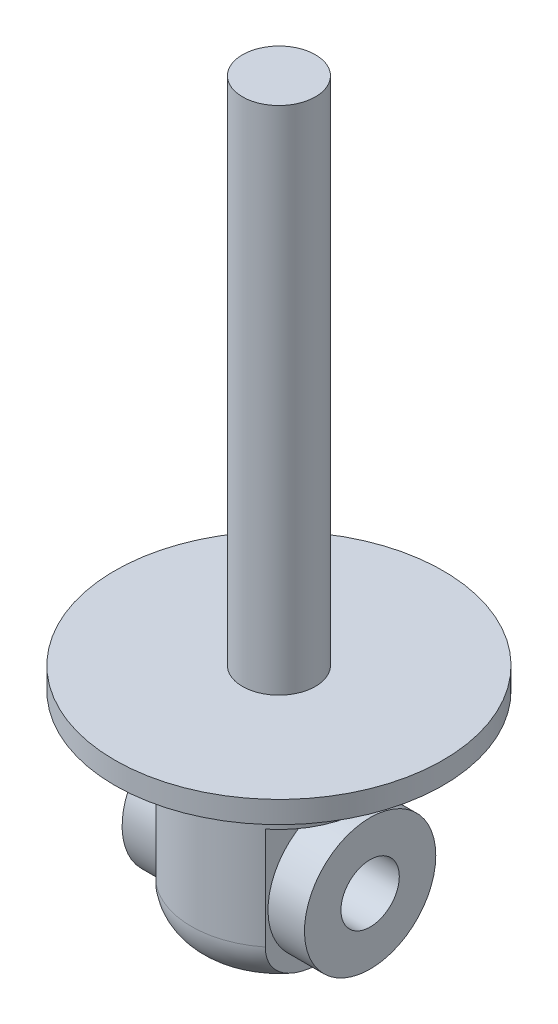
ISO-10303-21;
HEADER;
FILE_DESCRIPTION(('STEP AP214'),'2;1');
FILE_NAME('part.step','',(''),(''),'','','');
FILE_SCHEMA(('AUTOMOTIVE_DESIGN { 1 0 10303 214 1 1 1 1 }'));
ENDSEC;
DATA;
#1=APPLICATION_CONTEXT('core data for automotive mechanical design processes');
#2=APPLICATION_PROTOCOL_DEFINITION('international standard','automotive_design',2000,#1);
#3=PRODUCT_CONTEXT('',#1,'mechanical');
#4=PRODUCT('Part','Part','',(#3));
#5=PRODUCT_RELATED_PRODUCT_CATEGORY('part','',(#4));
#6=PRODUCT_DEFINITION_FORMATION('','',#4);
#7=PRODUCT_DEFINITION_CONTEXT('part definition',#1,'design');
#8=PRODUCT_DEFINITION('design','',#6,#7);
#9=PRODUCT_DEFINITION_SHAPE('','',#8);
#10=(LENGTH_UNIT() NAMED_UNIT(*) SI_UNIT(.MILLI.,.METRE.));
#11=(NAMED_UNIT(*) PLANE_ANGLE_UNIT() SI_UNIT($,.RADIAN.));
#12=(NAMED_UNIT(*) SI_UNIT($,.STERADIAN.) SOLID_ANGLE_UNIT());
#13=UNCERTAINTY_MEASURE_WITH_UNIT(LENGTH_MEASURE(1.E-05),#10,'distance_accuracy_value','');
#14=(GEOMETRIC_REPRESENTATION_CONTEXT(3) GLOBAL_UNCERTAINTY_ASSIGNED_CONTEXT((#13)) GLOBAL_UNIT_ASSIGNED_CONTEXT((#10,
#11,#12)) REPRESENTATION_CONTEXT('',''));
#15=CARTESIAN_POINT('',(0.,0.,0.));
#16=DIRECTION('',(0.,0.,1.));
#17=DIRECTION('',(1.,0.,0.));
#18=AXIS2_PLACEMENT_3D('',#15,#16,#17);
#19=CARTESIAN_POINT('',(-7.50000000000002,0.,-22.5));
#20=DIRECTION('',(1.,0.,0.));
#21=DIRECTION('',(0.,1.,0.));
#22=AXIS2_PLACEMENT_3D('',#19,#20,#21);
#23=PLANE('',#22);
#24=CARTESIAN_POINT('',(-7.50000000000001,-27.8094750193111,0.));
#25=CARTESIAN_POINT('',(-7.50000000000001,-27.8094752958151,0.18452162824242));
#26=CARTESIAN_POINT('',(-7.50000000000001,-27.8077270322999,0.369043480287192));
#27=CARTESIAN_POINT('',(-7.50000000000001,-27.8006130628877,0.737999394292286));
#28=CARTESIAN_POINT('',(-7.50000000000001,-27.7952477367066,0.922433463434386));
#29=CARTESIAN_POINT('',(-7.50000000000001,-27.780538513706,1.29122559425462));
#30=CARTESIAN_POINT('',(-7.50000000000001,-27.7711929215574,1.47558358999919));
#31=CARTESIAN_POINT('',(-7.50000000000001,-27.7479507640883,1.84401846668315));
#32=CARTESIAN_POINT('',(-7.50000000000001,-27.734054140347,2.0280953439834));
#33=CARTESIAN_POINT('',(-7.50000000000001,-27.701027325669,2.39498843631837));
#34=CARTESIAN_POINT('',(-7.50000000000001,-27.6819201299087,2.57780665418327));
#35=CARTESIAN_POINT('',(-7.50000000000001,-27.6375682217561,2.94269408038084));
#36=CARTESIAN_POINT('',(-7.50000000000001,-27.6123230495969,3.12476323156505));
#37=CARTESIAN_POINT('',(-7.50000000000001,-27.5259360262262,3.6691632505479));
#38=CARTESIAN_POINT('',(-7.50000000000001,-27.4541196223952,4.02997739530099));
#39=CARTESIAN_POINT('',(-7.50000000000001,-27.315114172541,4.57935988961709));
#40=CARTESIAN_POINT('',(-7.50000000000001,-27.2608348848703,4.7712225645297));
#41=CARTESIAN_POINT('',(-7.50000000000001,-27.1402411036094,5.15109529504943));
#42=CARTESIAN_POINT('',(-7.50000000000001,-27.0739312594077,5.3391068078654));
#43=CARTESIAN_POINT('',(-7.50000000000001,-26.9281486989919,5.70992505463464));
#44=CARTESIAN_POINT('',(-7.50000000000001,-26.8486797977089,5.8927332791208));
#45=CARTESIAN_POINT('',(-7.50000000000001,-26.6756224712841,6.25155879665883));
#46=CARTESIAN_POINT('',(-7.50000000000001,-26.5820364486501,6.42757723883459));
#47=CARTESIAN_POINT('',(-7.50000000000001,-26.3958384208508,6.74413785402998));
#48=CARTESIAN_POINT('',(-7.50000000000001,-26.3053527427416,6.8859302136676));
#49=CARTESIAN_POINT('',(-7.50000000000001,-26.1136422044668,7.16205254122039));
#50=CARTESIAN_POINT('',(-7.50000000000001,-26.0124194056704,7.29638393401336));
#51=CARTESIAN_POINT('',(-7.50000000000001,-25.7991822855038,7.55627452274061));
#52=CARTESIAN_POINT('',(-7.50000000000001,-25.6871652583255,7.6818315054992));
#53=CARTESIAN_POINT('',(-7.50000000000001,-25.4525813942248,7.92270374400352));
#54=CARTESIAN_POINT('',(-7.50000000000001,-25.3300144777409,8.03801892249803));
#55=CARTESIAN_POINT('',(-7.50000000000001,-25.0736714823962,8.25792234562975));
#56=CARTESIAN_POINT('',(-7.50000000000001,-24.9398051473305,8.36240569865935));
#57=CARTESIAN_POINT('',(-7.50000000000001,-24.662616920615,8.55796576900281));
#58=CARTESIAN_POINT('',(-7.50000000000001,-24.5192963548439,8.64904436046082));
#59=CARTESIAN_POINT('',(-7.50000000000001,-24.2243409104845,8.81636481076626));
#60=CARTESIAN_POINT('',(-7.50000000000001,-24.0727112205184,8.89261579636783));
#61=CARTESIAN_POINT('',(-7.50000000000001,-23.7624095052739,9.02909243430965));
#62=CARTESIAN_POINT('',(-7.50000000000001,-23.6037388369551,9.08932115899453));
#63=CARTESIAN_POINT('',(-7.50000000000001,-23.3052245459151,9.18495143349039));
#64=CARTESIAN_POINT('',(-7.50000000000001,-23.166136129491,9.22272405795733));
#65=CARTESIAN_POINT('',(-7.50000000000001,-22.8851087613884,9.28547940350163));
#66=CARTESIAN_POINT('',(-7.50000000000001,-22.7431701638949,9.31046370365636));
#67=CARTESIAN_POINT('',(-7.50000000000001,-22.4576599589478,9.34730641699015));
#68=CARTESIAN_POINT('',(-7.50000000000001,-22.3140890586128,9.35917031033291));
#69=CARTESIAN_POINT('',(-7.50000000000001,-22.0264648581988,9.36963164548865));
#70=CARTESIAN_POINT('',(-7.50000000000001,-21.8824115750842,9.36822954903947));
#71=CARTESIAN_POINT('',(-7.50000000000001,-21.6061914815275,9.35280339576897));
#72=CARTESIAN_POINT('',(-7.50000000000001,-21.4739684759153,9.339765699538));
#73=CARTESIAN_POINT('',(-7.50000000000001,-21.2110534946456,9.30256363878719));
#74=CARTESIAN_POINT('',(-7.50000000000001,-21.0803620180608,9.27839574533065));
#75=CARTESIAN_POINT('',(-7.50000000000001,-20.8215410609612,9.21922065645585));
#76=CARTESIAN_POINT('',(-7.50000000000001,-20.6934101253726,9.18421981495559));
#77=CARTESIAN_POINT('',(-7.50000000000001,-20.4404340442512,9.10374552536159));
#78=CARTESIAN_POINT('',(-7.50000000000001,-20.3155901493276,9.05826815366642));
#79=CARTESIAN_POINT('',(-7.50000000000001,-20.0692031015505,8.95699564520568));
#80=CARTESIAN_POINT('',(-7.50000000000001,-19.9476868658852,8.90113499399754));
#81=CARTESIAN_POINT('',(-7.50000000000001,-19.7094920695403,8.77987692751895));
#82=CARTESIAN_POINT('',(-7.50000000000001,-19.5928152563103,8.71447610526942));
#83=CARTESIAN_POINT('',(-7.50000000000001,-19.2509911073174,8.5048987585637));
#84=CARTESIAN_POINT('',(-7.50000000000001,-19.0339195251877,8.34729299116933));
#85=CARTESIAN_POINT('',(-7.50000000000001,-18.609337427954,7.98870608163152));
#86=CARTESIAN_POINT('',(-7.50000000000001,-18.4039002281567,7.785297559506));
#87=CARTESIAN_POINT('',(-7.50000000000001,-18.0246758733926,7.35109040646741));
#88=CARTESIAN_POINT('',(-7.50000000000001,-17.8508837047537,7.12029612399673));
#89=CARTESIAN_POINT('',(-7.50000000000001,-17.5744409595824,6.69864287979114));
#90=CARTESIAN_POINT('',(-7.50000000000001,-17.4648689537028,6.51223410047272));
#91=CARTESIAN_POINT('',(-7.50000000000001,-17.2626904112623,6.13034538679084));
#92=CARTESIAN_POINT('',(-7.50000000000001,-17.1700919878543,5.93486117014357));
#93=CARTESIAN_POINT('',(-7.50000000000001,-17.0006313082269,5.53658641063456));
#94=CARTESIAN_POINT('',(-7.50000000000001,-16.9238147555949,5.33377659321379));
#95=CARTESIAN_POINT('',(-7.50000000000001,-16.784875362625,4.92331428460808));
#96=CARTESIAN_POINT('',(-7.50000000000001,-16.7227484430634,4.71566315546473));
#97=CARTESIAN_POINT('',(-7.50000000000001,-16.5386673542946,4.02250667384634));
#98=CARTESIAN_POINT('',(-7.50000000000001,-16.4449803111871,3.5294265636988));
#99=CARTESIAN_POINT('',(-7.50000000000001,-16.3412352530644,2.78498720051465));
#100=CARTESIAN_POINT('',(-7.50000000000001,-16.3127705467372,2.53568557770048));
#101=CARTESIAN_POINT('',(-7.50000000000001,-16.2658269581612,2.03612434937437));
#102=CARTESIAN_POINT('',(-7.50000000000001,-16.2473468655649,1.7858648636814));
#103=CARTESIAN_POINT('',(-7.50000000000001,-16.2184283009414,1.28363112408651));
#104=CARTESIAN_POINT('',(-7.50000000000001,-16.208031590786,1.0316546617609));
#105=CARTESIAN_POINT('',(-7.50000000000001,-16.1941849220444,0.527501194688664));
#106=CARTESIAN_POINT('',(-7.50000000000001,-16.1907352988047,0.275324180848895));
#107=CARTESIAN_POINT('',(-7.50000000000001,-16.1903333462322,-0.228731345602994));
#108=CARTESIAN_POINT('',(-7.50000000000001,-16.193373232494,-0.480609853630193));
#109=CARTESIAN_POINT('',(-7.50000000000001,-16.2063332691715,-0.984173581494285));
#110=CARTESIAN_POINT('',(-7.50000000000001,-16.2162528039697,-1.23585881660876));
#111=CARTESIAN_POINT('',(-7.50000000000001,-16.2454935008677,-1.76278825668935));
#112=CARTESIAN_POINT('',(-7.50000000000001,-16.2656211327378,-2.03798990109173));
#113=CARTESIAN_POINT('',(-7.50000000000001,-16.3180418431018,-2.5873134597684));
#114=CARTESIAN_POINT('',(-7.50000000000001,-16.3503365349836,-2.86143522597445));
#115=CARTESIAN_POINT('',(-7.50000000000001,-16.4300545548583,-3.40623279358438));
#116=CARTESIAN_POINT('',(-7.50000000000001,-16.4774071358833,-3.67691867401875));
#117=CARTESIAN_POINT('',(-7.50000000000001,-16.5907053400646,-4.21439476079952));
#118=CARTESIAN_POINT('',(-7.50000000000001,-16.6566449229111,-4.48118620316471));
#119=CARTESIAN_POINT('',(-7.50000000000001,-16.7911834026755,-4.94217748017443));
#120=CARTESIAN_POINT('',(-7.50000000000001,-16.8549558474619,-5.13778160857808));
#121=CARTESIAN_POINT('',(-7.50000000000001,-16.9961265709521,-5.5239942274174));
#122=CARTESIAN_POINT('',(-7.50000000000001,-17.073520789267,-5.71460418712137));
#123=CARTESIAN_POINT('',(-7.50000000000001,-17.2430793617625,-6.08921987221889));
#124=CARTESIAN_POINT('',(-7.50000000000001,-17.3352463319138,-6.27322442084438));
#125=CARTESIAN_POINT('',(-7.50000000000001,-17.5351759469553,-6.63256976145457));
#126=CARTESIAN_POINT('',(-7.50000000000001,-17.6429345063483,-6.80791280693598));
#127=CARTESIAN_POINT('',(-7.50000000000001,-17.8487615005737,-7.10989658300674));
#128=CARTESIAN_POINT('',(-7.50000000000001,-17.9436617626469,-7.23870103997639));
#129=CARTESIAN_POINT('',(-7.50000000000001,-18.143229826346,-7.48856622066219));
#130=CARTESIAN_POINT('',(-7.50000000000001,-18.2478987883735,-7.60962602152205));
#131=CARTESIAN_POINT('',(-7.50000000000001,-18.4668045949393,-7.84271387792474));
#132=CARTESIAN_POINT('',(-7.50000000000001,-18.5810384459287,-7.95474473789612));
#133=CARTESIAN_POINT('',(-7.50000000000001,-18.8187268203134,-8.16854933672494));
#134=CARTESIAN_POINT('',(-7.50000000000001,-18.9421800591116,-8.27032449994957));
#135=CARTESIAN_POINT('',(-7.50000000000001,-19.1987356397018,-8.46313596223061));
#136=CARTESIAN_POINT('',(-7.50000000000001,-19.3319055781875,-8.55408255407202));
#137=CARTESIAN_POINT('',(-7.50000000000001,-19.6061418402457,-8.72304401015933));
#138=CARTESIAN_POINT('',(-7.50000000000001,-19.747204378254,-8.80106500403695));
#139=CARTESIAN_POINT('',(-7.50000000000001,-20.0362068877473,-8.94309470867638));
#140=CARTESIAN_POINT('',(-7.50000000000001,-20.1841460034049,-9.00710515749597));
#141=CARTESIAN_POINT('',(-7.50000000000001,-20.4856380297523,-9.12014361193692));
#142=CARTESIAN_POINT('',(-7.50000000000001,-20.6391901444676,-9.16917373274797));
#143=CARTESIAN_POINT('',(-7.50000000000001,-20.9313639562727,-9.2464339278708));
#144=CARTESIAN_POINT('',(-7.50000000000001,-21.0695088202567,-9.27647685632878));
#145=CARTESIAN_POINT('',(-7.50000000000001,-21.3479315795213,-9.3240614353689));
#146=CARTESIAN_POINT('',(-7.50000000000001,-21.4882092809527,-9.34160421520927));
#147=CARTESIAN_POINT('',(-7.50000000000001,-21.769719609589,-9.36396002322678));
#148=CARTESIAN_POINT('',(-7.50000000000001,-21.9109518422674,-9.3687780225304));
#149=CARTESIAN_POINT('',(-7.50000000000001,-22.1932734390957,-9.3656361390626));
#150=CARTESIAN_POINT('',(-7.50000000000001,-22.3343628067459,-9.35767657732181));
#151=CARTESIAN_POINT('',(-7.50000000000001,-22.6064011749062,-9.32998563551062));
#152=CARTESIAN_POINT('',(-7.50000000000001,-22.7374295539783,-9.31102660205278));
#153=CARTESIAN_POINT('',(-7.50000000000001,-22.9974780227225,-9.26218788836621));
#154=CARTESIAN_POINT('',(-7.50000000000001,-23.1264974548056,-9.23230470755186));
#155=CARTESIAN_POINT('',(-7.50000000000001,-23.3815508516768,-9.16196479385524));
#156=CARTESIAN_POINT('',(-7.50000000000001,-23.5075862018084,-9.12151307666087));
#157=CARTESIAN_POINT('',(-7.50000000000001,-23.7559772755244,-9.03044888037392));
#158=CARTESIAN_POINT('',(-7.50000000000001,-23.8783315975104,-8.97983258590812));
#159=CARTESIAN_POINT('',(-7.50000000000001,-24.1205569584555,-8.86806175742509));
#160=CARTESIAN_POINT('',(-7.50000000000001,-24.2403549182387,-8.8067487702029));
#161=CARTESIAN_POINT('',(-7.50000000000001,-24.4747211723639,-8.67480187441992));
#162=CARTESIAN_POINT('',(-7.50000000000001,-24.5892875713423,-8.60416462323316));
#163=CARTESIAN_POINT('',(-7.50000000000001,-24.9242270275788,-8.37928997825772));
#164=CARTESIAN_POINT('',(-7.50000000000001,-25.13600210755,-8.21201407264851));
#165=CARTESIAN_POINT('',(-7.50000000000001,-25.5504485361803,-7.83294273917799));
#166=CARTESIAN_POINT('',(-7.50000000000001,-25.7507010772538,-7.61853228584699));
#167=CARTESIAN_POINT('',(-7.50000000000001,-26.1185076671662,-7.16337882817297));
#168=CARTESIAN_POINT('',(-7.50000000000001,-26.2860513710234,-6.92262753032978));
#169=CARTESIAN_POINT('',(-7.50000000000001,-26.5545024709803,-6.47886643959529));
#170=CARTESIAN_POINT('',(-7.50000000000001,-26.6619013252763,-6.27970729507799));
#171=CARTESIAN_POINT('',(-7.50000000000001,-26.858559219587,-5.87254463104012));
#172=CARTESIAN_POINT('',(-7.50000000000001,-26.9478095430477,-5.664536919364));
#173=CARTESIAN_POINT('',(-7.50000000000001,-27.1096214973705,-5.24180758530232));
#174=CARTESIAN_POINT('',(-7.50000000000001,-27.1821555960046,-5.02707553901331));
#175=CARTESIAN_POINT('',(-7.50000000000001,-27.3121001369762,-4.59305326757355));
#176=CARTESIAN_POINT('',(-7.50000000000001,-27.3695048137837,-4.37376133898656));
#177=CARTESIAN_POINT('',(-7.50000000000001,-27.4981886749365,-3.81417726059936));
#178=CARTESIAN_POINT('',(-7.50000000000001,-27.5604951716191,-3.47183296905169));
#179=CARTESIAN_POINT('',(-7.50000000000001,-27.6609019684328,-2.78359200614869));
#180=CARTESIAN_POINT('',(-7.50000000000001,-27.6989863972919,-2.43769315620305));
#181=CARTESIAN_POINT('',(-7.50000000000001,-27.7425563308733,-1.91723181279187));
#182=CARTESIAN_POINT('',(-7.50000000000001,-27.7548291128016,-1.74318957751326));
#183=CARTESIAN_POINT('',(-7.50000000000001,-27.7753986995787,-1.39487161182967));
#184=CARTESIAN_POINT('',(-7.50000000000001,-27.7836956019396,-1.22059588725638));
#185=CARTESIAN_POINT('',(-7.50000000000001,-27.796777523185,-0.871965392986033));
#186=CARTESIAN_POINT('',(-7.50000000000001,-27.8015635129394,-0.697610658492164));
#187=CARTESIAN_POINT('',(-7.50000000000001,-27.8079121855994,-0.348837350643889));
#188=CARTESIAN_POINT('',(-7.50000000000001,-27.8094747579462,-0.174418775305036));
#189=CARTESIAN_POINT('',(-7.50000000000001,-27.8094750193111,0.));
#190=B_SPLINE_CURVE_WITH_KNOTS('',3,(#24,#25,#26,#27,#28,#29,#30,#31,#32,#33,#34,#35,#36,#37,
#38,#39,#40,#41,#42,#43,#44,#45,#46,#47,#48,#49,#50,#51,#52,#53,#54,#55,#56,#57,#58,#59,#60,#61,
#62,#63,#64,#65,#66,#67,#68,#69,#70,#71,#72,#73,#74,#75,#76,#77,#78,#79,#80,#81,#82,#83,#84,#85,
#86,#87,#88,#89,#90,#91,#92,#93,#94,#95,#96,#97,#98,#99,#100,#101,#102,#103,#104,#105,#106,#107,
#108,#109,#110,#111,#112,#113,#114,#115,#116,#117,#118,#119,#120,#121,#122,#123,#124,#125,#126,
#127,#128,#129,#130,#131,#132,#133,#134,#135,#136,#137,#138,#139,#140,#141,#142,#143,#144,#145,
#146,#147,#148,#149,#150,#151,#152,#153,#154,#155,#156,#157,#158,#159,#160,#161,#162,#163,#164,
#165,#166,#167,#168,#169,#170,#171,#172,#173,#174,#175,#176,#177,#178,#179,#180,#181,#182,#183,
#184,#185,#186,#187,#188,#189),.UNSPECIFIED.,.T.,.F.,(4,2,2,2,2,2,2,2,2,2,2,2,2,2,2,2,2,2,2,2,2,
2,2,2,2,2,2,2,2,2,2,2,2,2,2,2,2,2,2,2,2,2,2,2,2,2,2,2,2,2,2,2,2,2,2,2,2,2,2,2,2,2,2,2,2,2,2,2,2,
2,2,2,2,2,2,2,2,2,2,2,2,2,4),(0.,0.553556541747909,1.10705498067111,1.66078940935171,
2.21453094651203,2.7658672034967,3.31724477121586,4.41912680182767,5.01698525599298,
5.61461314908642,6.21206808675635,6.80942146164093,7.31357153503217,7.81762499361292,
8.32180513447662,8.82598907791494,9.33467160980089,9.84328295415676,10.3515802378956,
10.8597799828438,11.291588037567,11.7233427606026,12.1549170790764,12.5864763761707,
12.9845986570771,13.3828472534997,13.7808627038906,14.1790274594522,14.579795450788,
14.9807069160888,15.7821103743006,16.6461503316802,17.5100532757815,18.1578732554314,
18.8060020817716,19.4559821948789,20.1057815998326,21.6069748462106,22.3596793389022,
23.1122925673176,23.8687687149109,24.6252813779039,25.3808870860739,26.1364251884592,
26.9640249034878,27.7917343993232,28.6156111127982,29.4392203950451,30.0559954213971,
30.6725869093732,31.2892877047367,31.9058271963483,32.3853559200308,32.8649416785199,
33.3443778968313,33.823747436381,34.3068464150843,34.7897156366603,35.2725249226045,
35.7552660053908,36.1788379642465,36.6023716529343,37.0257398573389,37.4490974249689,
37.8458122806135,38.2426543730445,38.639308470493,39.0361117351622,39.4393886143668,
39.8428104576492,40.6491243408277,41.5260051520067,42.4031628508039,43.0810551134699,
43.7592721958252,44.4385984678267,45.1181832448308,46.1608437011148,47.2041866484774,
47.7275747628343,48.2509500399341,48.7741805338585,49.2974289735857),.UNSPECIFIED.);
#191=CARTESIAN_POINT('',(-7.50000000000001,-22.,-9.36749699759759));
#192=VERTEX_POINT('',#191);
#193=CARTESIAN_POINT('',(-7.50000000000001,-21.9999999999999,9.36749699759765));
#194=VERTEX_POINT('',#193);
#195=EDGE_CURVE('E144',#192,#194,#190,.T.);
#196=ORIENTED_EDGE('',*,*,#195,.T.);
#197=DIRECTION('',(0.,1.,0.));
#198=VECTOR('',#197,1.);
#199=CARTESIAN_POINT('',(-7.5,-28.,9.3674969975976));
#200=LINE('',#199,#198);
#201=CARTESIAN_POINT('',(-7.50000000000001,-8.,9.36749699759758));
#202=VERTEX_POINT('',#201);
#203=EDGE_CURVE('E98',#202,#194,#200,.F.);
#204=ORIENTED_EDGE('',*,*,#203,.F.);
#205=DIRECTION('',(0.,0.,1.));
#206=VECTOR('',#205,1.);
#207=CARTESIAN_POINT('',(-7.50000000000001,-8.,-22.5));
#208=LINE('',#207,#206);
#209=CARTESIAN_POINT('',(-7.50000000000001,-8.,-9.3674969975976));
#210=VERTEX_POINT('',#209);
#211=EDGE_CURVE('E91',#210,#202,#208,.T.);
#212=ORIENTED_EDGE('',*,*,#211,.F.);
#213=DIRECTION('',(0.,1.,0.));
#214=VECTOR('',#213,1.);
#215=CARTESIAN_POINT('',(-7.5,-28.,-9.3674969975976));
#216=LINE('',#215,#214);
#217=EDGE_CURVE('E69',#192,#210,#216,.T.);
#218=ORIENTED_EDGE('',*,*,#217,.F.);
#219=EDGE_LOOP('',(#196,#204,#212,#218));
#220=FACE_BOUND('',#219,.T.);
#221=CARTESIAN_POINT('',(-7.50000000000001,-17.809475224568,0.));
#222=DIRECTION('',(1.,0.,0.));
#223=DIRECTION('',(0.,1.,0.));
#224=AXIS2_PLACEMENT_3D('',#221,#222,#223);
#225=CIRCLE('',#224,9.);
#226=CARTESIAN_POINT('',(-7.50000000000001,-8.809475224568,0.));
#227=VERTEX_POINT('',#226);
#228=EDGE_CURVE('E12',#227,#227,#225,.F.);
#229=ORIENTED_EDGE('',*,*,#228,.F.);
#230=EDGE_LOOP('',(#229));
#231=FACE_BOUND('',#230,.T.);
#232=ADVANCED_FACE('F42',(#220,#231),#23,.F.);
#233=CARTESIAN_POINT('',(7.50000000000001,0.,-22.5));
#234=DIRECTION('',(1.,0.,0.));
#235=DIRECTION('',(0.,1.,0.));
#236=AXIS2_PLACEMENT_3D('',#233,#234,#235);
#237=PLANE('',#236);
#238=DIRECTION('',(0.,1.,0.));
#239=VECTOR('',#238,1.);
#240=CARTESIAN_POINT('',(7.50000000000001,-28.,-9.36749699759759));
#241=LINE('',#240,#239);
#242=CARTESIAN_POINT('',(7.50000000000002,-22.,-9.36749699759759));
#243=VERTEX_POINT('',#242);
#244=CARTESIAN_POINT('',(7.50000000000001,-8.,-9.36749699759759));
#245=VERTEX_POINT('',#244);
#246=EDGE_CURVE('E111',#243,#245,#241,.T.);
#247=ORIENTED_EDGE('',*,*,#246,.T.);
#248=DIRECTION('',(0.,0.,1.));
#249=VECTOR('',#248,1.);
#250=CARTESIAN_POINT('',(7.50000000000001,-8.,-22.5));
#251=LINE('',#250,#249);
#252=CARTESIAN_POINT('',(7.50000000000001,-8.,9.36749699759759));
#253=VERTEX_POINT('',#252);
#254=EDGE_CURVE('E100',#245,#253,#251,.T.);
#255=ORIENTED_EDGE('',*,*,#254,.T.);
#256=DIRECTION('',(0.,1.,0.));
#257=VECTOR('',#256,1.);
#258=CARTESIAN_POINT('',(7.50000000000001,-28.,9.36749699759759));
#259=LINE('',#258,#257);
#260=CARTESIAN_POINT('',(7.50000000000002,-22.,9.36749699759759));
#261=VERTEX_POINT('',#260);
#262=EDGE_CURVE('E61',#253,#261,#259,.F.);
#263=ORIENTED_EDGE('',*,*,#262,.T.);
#264=CARTESIAN_POINT('',(7.50000000000002,-27.8094750193111,0.));
#265=CARTESIAN_POINT('',(7.50000000000002,-27.8094752958151,0.18452162824242));
#266=CARTESIAN_POINT('',(7.50000000000002,-27.8077270322999,0.369043480287193));
#267=CARTESIAN_POINT('',(7.50000000000002,-27.8006130628877,0.737999394292287));
#268=CARTESIAN_POINT('',(7.50000000000002,-27.7952477367066,0.922433463434387));
#269=CARTESIAN_POINT('',(7.50000000000002,-27.780538513706,1.29122559425462));
#270=CARTESIAN_POINT('',(7.50000000000002,-27.7711929215574,1.47558358999919));
#271=CARTESIAN_POINT('',(7.50000000000002,-27.7479507640883,1.84401846668316));
#272=CARTESIAN_POINT('',(7.50000000000002,-27.734054140347,2.0280953439834));
#273=CARTESIAN_POINT('',(7.50000000000002,-27.701027325669,2.39498843631838));
#274=CARTESIAN_POINT('',(7.50000000000002,-27.6819201299087,2.57780665418327));
#275=CARTESIAN_POINT('',(7.50000000000002,-27.6375682217561,2.94269408038084));
#276=CARTESIAN_POINT('',(7.50000000000002,-27.6123230495969,3.12476323156506));
#277=CARTESIAN_POINT('',(7.50000000000002,-27.5259360262262,3.66916325054791));
#278=CARTESIAN_POINT('',(7.50000000000002,-27.4541196223952,4.029977395301));
#279=CARTESIAN_POINT('',(7.50000000000002,-27.315114172541,4.5793598896171));
#280=CARTESIAN_POINT('',(7.50000000000002,-27.2608348848703,4.7712225645297));
#281=CARTESIAN_POINT('',(7.50000000000002,-27.1402411036094,5.15109529504943));
#282=CARTESIAN_POINT('',(7.50000000000002,-27.0739312594077,5.3391068078654));
#283=CARTESIAN_POINT('',(7.50000000000002,-26.9281486989919,5.70992505463464));
#284=CARTESIAN_POINT('',(7.50000000000002,-26.8486797977089,5.8927332791208));
#285=CARTESIAN_POINT('',(7.50000000000002,-26.6756224712841,6.25155879665883));
#286=CARTESIAN_POINT('',(7.50000000000002,-26.5820364486501,6.42757723883459));
#287=CARTESIAN_POINT('',(7.50000000000002,-26.3958384208508,6.74413785402998));
#288=CARTESIAN_POINT('',(7.50000000000002,-26.3053527427416,6.8859302136676));
#289=CARTESIAN_POINT('',(7.50000000000002,-26.1136422044668,7.16205254122039));
#290=CARTESIAN_POINT('',(7.50000000000002,-26.0124194056704,7.29638393401336));
#291=CARTESIAN_POINT('',(7.50000000000002,-25.7991822855038,7.55627452274061));
#292=CARTESIAN_POINT('',(7.50000000000002,-25.6871652583255,7.6818315054992));
#293=CARTESIAN_POINT('',(7.50000000000002,-25.4525813942248,7.92270374400351));
#294=CARTESIAN_POINT('',(7.50000000000002,-25.3300144777409,8.03801892249802));
#295=CARTESIAN_POINT('',(7.50000000000002,-25.0736714823962,8.25792234562975));
#296=CARTESIAN_POINT('',(7.50000000000002,-24.9398051473305,8.36240569865934));
#297=CARTESIAN_POINT('',(7.50000000000002,-24.662616920615,8.55796576900281));
#298=CARTESIAN_POINT('',(7.50000000000002,-24.5192963548439,8.64904436046082));
#299=CARTESIAN_POINT('',(7.50000000000002,-24.2243409104845,8.81636481076626));
#300=CARTESIAN_POINT('',(7.50000000000002,-24.0727112205184,8.89261579636783));
#301=CARTESIAN_POINT('',(7.50000000000002,-23.7624095052739,9.02909243430964));
#302=CARTESIAN_POINT('',(7.50000000000002,-23.6037388369551,9.08932115899452));
#303=CARTESIAN_POINT('',(7.50000000000002,-23.3052245459151,9.18495143349039));
#304=CARTESIAN_POINT('',(7.50000000000002,-23.166136129491,9.22272405795732));
#305=CARTESIAN_POINT('',(7.50000000000002,-22.8851087613883,9.28547940350162));
#306=CARTESIAN_POINT('',(7.50000000000002,-22.7431701638949,9.31046370365636));
#307=CARTESIAN_POINT('',(7.50000000000002,-22.4576599589478,9.34730641699014));
#308=CARTESIAN_POINT('',(7.50000000000002,-22.3140890586128,9.35917031033291));
#309=CARTESIAN_POINT('',(7.50000000000002,-22.0264648581988,9.36963164548864));
#310=CARTESIAN_POINT('',(7.50000000000002,-21.8824115750842,9.36822954903946));
#311=CARTESIAN_POINT('',(7.50000000000002,-21.6061914815275,9.35280339576897));
#312=CARTESIAN_POINT('',(7.50000000000002,-21.4739684759153,9.339765699538));
#313=CARTESIAN_POINT('',(7.50000000000002,-21.2110534946456,9.30256363878719));
#314=CARTESIAN_POINT('',(7.50000000000002,-21.0803620180608,9.27839574533064));
#315=CARTESIAN_POINT('',(7.50000000000002,-20.8215410609612,9.21922065645584));
#316=CARTESIAN_POINT('',(7.50000000000002,-20.6934101253726,9.18421981495559));
#317=CARTESIAN_POINT('',(7.50000000000002,-20.4404340442512,9.10374552536158));
#318=CARTESIAN_POINT('',(7.50000000000002,-20.3155901493276,9.05826815366641));
#319=CARTESIAN_POINT('',(7.50000000000002,-20.0692031015505,8.95699564520567));
#320=CARTESIAN_POINT('',(7.50000000000002,-19.9476868658852,8.90113499399754));
#321=CARTESIAN_POINT('',(7.50000000000002,-19.7094920695403,8.77987692751895));
#322=CARTESIAN_POINT('',(7.50000000000002,-19.5928152563103,8.71447610526941));
#323=CARTESIAN_POINT('',(7.50000000000002,-19.2509911073174,8.5048987585637));
#324=CARTESIAN_POINT('',(7.50000000000002,-19.0339195251877,8.34729299116932));
#325=CARTESIAN_POINT('',(7.50000000000002,-18.609337427954,7.98870608163151));
#326=CARTESIAN_POINT('',(7.50000000000002,-18.4039002281567,7.78529755950599));
#327=CARTESIAN_POINT('',(7.50000000000002,-18.0246758733926,7.35109040646741));
#328=CARTESIAN_POINT('',(7.50000000000002,-17.8508837047537,7.12029612399672));
#329=CARTESIAN_POINT('',(7.50000000000002,-17.5744409595824,6.69864287979113));
#330=CARTESIAN_POINT('',(7.50000000000002,-17.4648689537028,6.51223410047271));
#331=CARTESIAN_POINT('',(7.50000000000002,-17.2626904112623,6.13034538679084));
#332=CARTESIAN_POINT('',(7.50000000000002,-17.1700919878543,5.93486117014356));
#333=CARTESIAN_POINT('',(7.50000000000002,-17.0006313082269,5.53658641063455));
#334=CARTESIAN_POINT('',(7.50000000000002,-16.9238147555949,5.33377659321378));
#335=CARTESIAN_POINT('',(7.50000000000002,-16.784875362625,4.92331428460808));
#336=CARTESIAN_POINT('',(7.50000000000002,-16.7227484430634,4.71566315546472));
#337=CARTESIAN_POINT('',(7.50000000000002,-16.5386673542946,4.02250667384633));
#338=CARTESIAN_POINT('',(7.50000000000002,-16.4449803111871,3.52942656369879));
#339=CARTESIAN_POINT('',(7.50000000000002,-16.3412352530644,2.78498720051464));
#340=CARTESIAN_POINT('',(7.50000000000002,-16.3127705467372,2.53568557770048));
#341=CARTESIAN_POINT('',(7.50000000000002,-16.2658269581612,2.03612434937436));
#342=CARTESIAN_POINT('',(7.50000000000002,-16.2473468655649,1.7858648636814));
#343=CARTESIAN_POINT('',(7.50000000000002,-16.2184283009414,1.2836311240865));
#344=CARTESIAN_POINT('',(7.50000000000002,-16.208031590786,1.03165466176089));
#345=CARTESIAN_POINT('',(7.50000000000002,-16.1941849220444,0.527501194688662));
#346=CARTESIAN_POINT('',(7.50000000000002,-16.1907352988047,0.275324180848892));
#347=CARTESIAN_POINT('',(7.50000000000002,-16.1903333462322,-0.228731345602995));
#348=CARTESIAN_POINT('',(7.50000000000002,-16.193373232494,-0.480609853630193));
#349=CARTESIAN_POINT('',(7.50000000000002,-16.2063332691715,-0.984173581494286));
#350=CARTESIAN_POINT('',(7.50000000000002,-16.2162528039697,-1.23585881660876));
#351=CARTESIAN_POINT('',(7.50000000000002,-16.2454935008677,-1.76278825668935));
#352=CARTESIAN_POINT('',(7.50000000000002,-16.2656211327378,-2.03798990109173));
#353=CARTESIAN_POINT('',(7.50000000000002,-16.3180418431018,-2.5873134597684));
#354=CARTESIAN_POINT('',(7.50000000000002,-16.3503365349836,-2.86143522597445));
#355=CARTESIAN_POINT('',(7.50000000000002,-16.4300545548583,-3.40623279358438));
#356=CARTESIAN_POINT('',(7.50000000000002,-16.4774071358833,-3.67691867401874));
#357=CARTESIAN_POINT('',(7.50000000000002,-16.5907053400646,-4.21439476079952));
#358=CARTESIAN_POINT('',(7.50000000000002,-16.6566449229111,-4.4811862031647));
#359=CARTESIAN_POINT('',(7.50000000000002,-16.7911834026755,-4.94217748017443));
#360=CARTESIAN_POINT('',(7.50000000000002,-16.8549558474619,-5.13778160857807));
#361=CARTESIAN_POINT('',(7.50000000000002,-16.9961265709521,-5.5239942274174));
#362=CARTESIAN_POINT('',(7.50000000000002,-17.073520789267,-5.71460418712137));
#363=CARTESIAN_POINT('',(7.50000000000002,-17.2430793617625,-6.08921987221889));
#364=CARTESIAN_POINT('',(7.50000000000002,-17.3352463319138,-6.27322442084439));
#365=CARTESIAN_POINT('',(7.50000000000002,-17.5351759469554,-6.63256976145457));
#366=CARTESIAN_POINT('',(7.50000000000002,-17.6429345063483,-6.80791280693598));
#367=CARTESIAN_POINT('',(7.50000000000002,-17.8487615005737,-7.10989658300674));
#368=CARTESIAN_POINT('',(7.50000000000002,-17.9436617626469,-7.23870103997639));
#369=CARTESIAN_POINT('',(7.50000000000002,-18.143229826346,-7.48856622066219));
#370=CARTESIAN_POINT('',(7.50000000000002,-18.2478987883735,-7.60962602152204));
#371=CARTESIAN_POINT('',(7.50000000000002,-18.4668045949393,-7.84271387792474));
#372=CARTESIAN_POINT('',(7.50000000000002,-18.5810384459287,-7.95474473789612));
#373=CARTESIAN_POINT('',(7.50000000000002,-18.8187268203134,-8.16854933672494));
#374=CARTESIAN_POINT('',(7.50000000000002,-18.9421800591116,-8.27032449994956));
#375=CARTESIAN_POINT('',(7.50000000000002,-19.1987356397018,-8.4631359622306));
#376=CARTESIAN_POINT('',(7.50000000000002,-19.3319055781875,-8.55408255407202));
#377=CARTESIAN_POINT('',(7.50000000000002,-19.6061418402457,-8.72304401015933));
#378=CARTESIAN_POINT('',(7.50000000000002,-19.747204378254,-8.80106500403695));
#379=CARTESIAN_POINT('',(7.50000000000002,-20.0362068877473,-8.94309470867638));
#380=CARTESIAN_POINT('',(7.50000000000002,-20.1841460034049,-9.00710515749597));
#381=CARTESIAN_POINT('',(7.50000000000002,-20.4856380297523,-9.12014361193692));
#382=CARTESIAN_POINT('',(7.50000000000002,-20.6391901444676,-9.16917373274797));
#383=CARTESIAN_POINT('',(7.50000000000002,-20.9313639562727,-9.2464339278708));
#384=CARTESIAN_POINT('',(7.50000000000002,-21.0695088202567,-9.27647685632878));
#385=CARTESIAN_POINT('',(7.50000000000002,-21.3479315795213,-9.3240614353689));
#386=CARTESIAN_POINT('',(7.50000000000002,-21.4882092809526,-9.34160421520927));
#387=CARTESIAN_POINT('',(7.50000000000002,-21.769719609589,-9.36396002322677));
#388=CARTESIAN_POINT('',(7.50000000000002,-21.9109518422674,-9.3687780225304));
#389=CARTESIAN_POINT('',(7.50000000000002,-22.1932734390957,-9.36563613906259));
#390=CARTESIAN_POINT('',(7.50000000000002,-22.3343628067459,-9.3576765773218));
#391=CARTESIAN_POINT('',(7.50000000000002,-22.6064011749062,-9.32998563551061));
#392=CARTESIAN_POINT('',(7.50000000000002,-22.7374295539783,-9.31102660205277));
#393=CARTESIAN_POINT('',(7.50000000000002,-22.9974780227225,-9.2621878883662));
#394=CARTESIAN_POINT('',(7.50000000000002,-23.1264974548056,-9.23230470755186));
#395=CARTESIAN_POINT('',(7.50000000000002,-23.3815508516768,-9.16196479385524));
#396=CARTESIAN_POINT('',(7.50000000000002,-23.5075862018083,-9.12151307666087));
#397=CARTESIAN_POINT('',(7.50000000000002,-23.7559772755244,-9.03044888037391));
#398=CARTESIAN_POINT('',(7.50000000000002,-23.8783315975104,-8.97983258590812));
#399=CARTESIAN_POINT('',(7.50000000000002,-24.1205569584555,-8.86806175742509));
#400=CARTESIAN_POINT('',(7.50000000000002,-24.2403549182387,-8.80674877020289));
#401=CARTESIAN_POINT('',(7.50000000000002,-24.4747211723639,-8.67480187441992));
#402=CARTESIAN_POINT('',(7.50000000000002,-24.5892875713423,-8.60416462323315));
#403=CARTESIAN_POINT('',(7.50000000000002,-24.9242270275788,-8.37928997825772));
#404=CARTESIAN_POINT('',(7.50000000000002,-25.13600210755,-8.21201407264851));
#405=CARTESIAN_POINT('',(7.50000000000002,-25.5504485361803,-7.83294273917799));
#406=CARTESIAN_POINT('',(7.50000000000002,-25.7507010772538,-7.61853228584698));
#407=CARTESIAN_POINT('',(7.50000000000002,-26.1185076671662,-7.16337882817297));
#408=CARTESIAN_POINT('',(7.50000000000002,-26.2860513710234,-6.92262753032978));
#409=CARTESIAN_POINT('',(7.50000000000002,-26.5545024709803,-6.47886643959529));
#410=CARTESIAN_POINT('',(7.50000000000002,-26.6619013252763,-6.27970729507798));
#411=CARTESIAN_POINT('',(7.50000000000002,-26.858559219587,-5.87254463104011));
#412=CARTESIAN_POINT('',(7.50000000000002,-26.9478095430477,-5.664536919364));
#413=CARTESIAN_POINT('',(7.50000000000002,-27.1096214973705,-5.24180758530231));
#414=CARTESIAN_POINT('',(7.50000000000002,-27.1821555960046,-5.0270755390133));
#415=CARTESIAN_POINT('',(7.50000000000002,-27.3121001369762,-4.59305326757354));
#416=CARTESIAN_POINT('',(7.50000000000002,-27.3695048137837,-4.37376133898655));
#417=CARTESIAN_POINT('',(7.50000000000002,-27.4981886749365,-3.81417726059935));
#418=CARTESIAN_POINT('',(7.50000000000002,-27.5604951716191,-3.47183296905168));
#419=CARTESIAN_POINT('',(7.50000000000002,-27.6609019684328,-2.78359200614868));
#420=CARTESIAN_POINT('',(7.50000000000002,-27.6989863972919,-2.43769315620304));
#421=CARTESIAN_POINT('',(7.50000000000002,-27.7425563308733,-1.91723181279187));
#422=CARTESIAN_POINT('',(7.50000000000002,-27.7548291128016,-1.74318957751326));
#423=CARTESIAN_POINT('',(7.50000000000002,-27.7753986995787,-1.39487161182966));
#424=CARTESIAN_POINT('',(7.50000000000002,-27.7836956019396,-1.22059588725638));
#425=CARTESIAN_POINT('',(7.50000000000002,-27.796777523185,-0.871965392986033));
#426=CARTESIAN_POINT('',(7.50000000000002,-27.8015635129393,-0.697610658492164));
#427=CARTESIAN_POINT('',(7.50000000000002,-27.8079121855994,-0.348837350643888));
#428=CARTESIAN_POINT('',(7.50000000000002,-27.8094747579462,-0.174418775305036));
#429=CARTESIAN_POINT('',(7.50000000000002,-27.8094750193111,0.));
#430=B_SPLINE_CURVE_WITH_KNOTS('',3,(#264,#265,#266,#267,#268,#269,#270,#271,#272,#273,#274,
#275,#276,#277,#278,#279,#280,#281,#282,#283,#284,#285,#286,#287,#288,#289,#290,#291,#292,#293,
#294,#295,#296,#297,#298,#299,#300,#301,#302,#303,#304,#305,#306,#307,#308,#309,#310,#311,#312,
#313,#314,#315,#316,#317,#318,#319,#320,#321,#322,#323,#324,#325,#326,#327,#328,#329,#330,#331,
#332,#333,#334,#335,#336,#337,#338,#339,#340,#341,#342,#343,#344,#345,#346,#347,#348,#349,#350,
#351,#352,#353,#354,#355,#356,#357,#358,#359,#360,#361,#362,#363,#364,#365,#366,#367,#368,#369,
#370,#371,#372,#373,#374,#375,#376,#377,#378,#379,#380,#381,#382,#383,#384,#385,#386,#387,#388,
#389,#390,#391,#392,#393,#394,#395,#396,#397,#398,#399,#400,#401,#402,#403,#404,#405,#406,#407,
#408,#409,#410,#411,#412,#413,#414,#415,#416,#417,#418,#419,#420,#421,#422,#423,#424,#425,#426,
#427,#428,#429),.UNSPECIFIED.,.T.,.F.,(4,2,2,2,2,2,2,2,2,2,2,2,2,2,2,2,2,2,2,2,2,2,2,2,2,2,2,2,
2,2,2,2,2,2,2,2,2,2,2,2,2,2,2,2,2,2,2,2,2,2,2,2,2,2,2,2,2,2,2,2,2,2,2,2,2,2,2,2,2,2,2,2,2,2,2,2,
2,2,2,2,2,2,4),(0.,0.55355654174791,1.10705498067111,1.66078940935171,2.21453094651204,
2.7658672034967,3.31724477121586,4.41912680182768,5.01698525599298,5.61461314908643,
6.21206808675634,6.80942146164093,7.31357153503217,7.81762499361292,8.32180513447662,
8.82598907791493,9.33467160980088,9.84328295415676,10.3515802378956,10.8597799828438,
11.291588037567,11.7233427606026,12.1549170790764,12.5864763761706,12.9845986570771,
13.3828472534997,13.7808627038906,14.1790274594521,14.579795450788,14.9807069160888,
15.7821103743006,16.6461503316802,17.5100532757814,18.1578732554314,18.8060020817716,
19.4559821948788,20.1057815998326,21.6069748462105,22.3596793389022,23.1122925673176,
23.8687687149109,24.6252813779039,25.3808870860739,26.1364251884592,26.9640249034878,
27.7917343993232,28.6156111127982,29.4392203950451,30.0559954213971,30.6725869093732,
31.2892877047367,31.9058271963482,32.3853559200307,32.8649416785199,33.3443778968313,
33.823747436381,34.3068464150843,34.7897156366603,35.2725249226045,35.7552660053907,
36.1788379642464,36.6023716529342,37.0257398573389,37.4490974249688,37.8458122806135,
38.2426543730444,38.6393084704929,39.0361117351622,39.4393886143667,39.8428104576491,
40.6491243408276,41.5260051520067,42.4031628508039,43.0810551134699,43.7592721958252,
44.4385984678267,45.1181832448308,46.1608437011148,47.2041866484774,47.7275747628343,
48.250950039934,48.7741805338585,49.2974289735856),.UNSPECIFIED.);
#431=EDGE_CURVE('E95',#243,#261,#430,.T.);
#432=ORIENTED_EDGE('',*,*,#431,.F.);
#433=EDGE_LOOP('',(#247,#255,#263,#432));
#434=FACE_BOUND('',#433,.T.);
#435=CARTESIAN_POINT('',(7.50000000000002,-17.809475224568,0.));
#436=DIRECTION('',(1.,0.,0.));
#437=DIRECTION('',(0.,1.,0.));
#438=AXIS2_PLACEMENT_3D('',#435,#436,#437);
#439=CIRCLE('',#438,9.);
#440=CARTESIAN_POINT('',(7.50000000000002,-8.809475224568,0.));
#441=VERTEX_POINT('',#440);
#442=EDGE_CURVE('E47',#441,#441,#439,.F.);
#443=ORIENTED_EDGE('',*,*,#442,.T.);
#444=EDGE_LOOP('',(#443));
#445=FACE_BOUND('',#444,.T.);
#446=ADVANCED_FACE('F159',(#434,#445),#237,.T.);
#447=CARTESIAN_POINT('',(0.,-28.,0.));
#448=DIRECTION('',(0.,1.,0.));
#449=DIRECTION('',(0.,0.,1.));
#450=AXIS2_PLACEMENT_3D('',#447,#448,#449);
#451=CYLINDRICAL_SURFACE('',#450,12.);
#452=CARTESIAN_POINT('',(0.,0.,0.));
#453=DIRECTION('',(0.,-1.,0.));
#454=DIRECTION('',(0.,0.,-1.));
#455=AXIS2_PLACEMENT_3D('',#452,#453,#454);
#456=CIRCLE('',#455,12.);
#457=CARTESIAN_POINT('',(0.,0.,-12.));
#458=VERTEX_POINT('',#457);
#459=EDGE_CURVE('E118',#458,#458,#456,.T.);
#460=ORIENTED_EDGE('',*,*,#459,.T.);
#461=EDGE_LOOP('',(#460));
#462=FACE_BOUND('',#461,.T.);
#463=ORIENTED_EDGE('',*,*,#246,.F.);
#464=CARTESIAN_POINT('',(0.,-22.,0.));
#465=DIRECTION('',(0.,-1.,0.));
#466=DIRECTION('',(0.,0.,-1.));
#467=AXIS2_PLACEMENT_3D('',#464,#465,#466);
#468=CIRCLE('',#467,12.);
#469=EDGE_CURVE('E106',#243,#192,#468,.F.);
#470=ORIENTED_EDGE('',*,*,#469,.T.);
#471=ORIENTED_EDGE('',*,*,#217,.T.);
#472=CARTESIAN_POINT('',(0.,-8.,0.));
#473=DIRECTION('',(0.,1.,0.));
#474=DIRECTION('',(-1.,0.,0.));
#475=AXIS2_PLACEMENT_3D('',#472,#473,#474);
#476=CIRCLE('',#475,12.);
#477=EDGE_CURVE('E89',#210,#202,#476,.T.);
#478=ORIENTED_EDGE('',*,*,#477,.T.);
#479=ORIENTED_EDGE('',*,*,#203,.T.);
#480=EDGE_CURVE('E143',#194,#261,#468,.F.);
#481=ORIENTED_EDGE('',*,*,#480,.T.);
#482=ORIENTED_EDGE('',*,*,#262,.F.);
#483=CARTESIAN_POINT('',(0.,-8.,0.));
#484=DIRECTION('',(0.,-1.,0.));
#485=DIRECTION('',(0.,0.,-1.));
#486=AXIS2_PLACEMENT_3D('',#483,#484,#485);
#487=CIRCLE('',#486,12.);
#488=EDGE_CURVE('E53',#245,#253,#487,.T.);
#489=ORIENTED_EDGE('',*,*,#488,.F.);
#490=EDGE_LOOP('',(#463,#470,#471,#478,#479,#481,#482,#489));
#491=FACE_BOUND('',#490,.T.);
#492=ADVANCED_FACE('F104',(#462,#491),#451,.T.);
#493=CARTESIAN_POINT('',(0.,-22.,0.));
#494=DIRECTION('',(0.,-1.,0.));
#495=DIRECTION('',(0.,0.,-1.));
#496=AXIS2_PLACEMENT_3D('',#493,#494,#495);
#497=TOROIDAL_SURFACE('',#496,6.,6.);
#498=CARTESIAN_POINT('',(0.,-28.,0.));
#499=DIRECTION('',(0.,-1.,0.));
#500=DIRECTION('',(0.,0.,-1.));
#501=AXIS2_PLACEMENT_3D('',#498,#499,#500);
#502=CIRCLE('',#501,6.);
#503=CARTESIAN_POINT('',(0.,-28.,-6.));
#504=VERTEX_POINT('',#503);
#505=EDGE_CURVE('E122',#504,#504,#502,.T.);
#506=ORIENTED_EDGE('',*,*,#505,.F.);
#507=EDGE_LOOP('',(#506));
#508=FACE_BOUND('',#507,.T.);
#509=ORIENTED_EDGE('',*,*,#469,.F.);
#510=ORIENTED_EDGE('',*,*,#431,.T.);
#511=ORIENTED_EDGE('',*,*,#480,.F.);
#512=ORIENTED_EDGE('',*,*,#195,.F.);
#513=EDGE_LOOP('',(#509,#510,#511,#512));
#514=FACE_BOUND('',#513,.T.);
#515=ADVANCED_FACE('F44',(#508,#514),#497,.T.);
#516=CARTESIAN_POINT('',(0.,3.,0.));
#517=DIRECTION('',(0.,-1.,0.));
#518=DIRECTION('',(0.,0.,-1.));
#519=AXIS2_PLACEMENT_3D('',#516,#517,#518);
#520=CYLINDRICAL_SURFACE('',#519,22.5);
#521=CARTESIAN_POINT('',(0.,3.,0.));
#522=DIRECTION('',(0.,1.,0.));
#523=DIRECTION('',(0.,0.,1.));
#524=AXIS2_PLACEMENT_3D('',#521,#522,#523);
#525=CIRCLE('',#524,22.5);
#526=CARTESIAN_POINT('',(0.,3.,22.5));
#527=VERTEX_POINT('',#526);
#528=EDGE_CURVE('E131',#527,#527,#525,.T.);
#529=ORIENTED_EDGE('',*,*,#528,.F.);
#530=EDGE_LOOP('',(#529));
#531=FACE_BOUND('',#530,.T.);
#532=CARTESIAN_POINT('',(0.,0.,0.));
#533=DIRECTION('',(0.,1.,0.));
#534=DIRECTION('',(0.,0.,1.));
#535=AXIS2_PLACEMENT_3D('',#532,#533,#534);
#536=CIRCLE('',#535,22.5);
#537=CARTESIAN_POINT('',(0.,0.,22.5));
#538=VERTEX_POINT('',#537);
#539=EDGE_CURVE('E127',#538,#538,#536,.T.);
#540=ORIENTED_EDGE('',*,*,#539,.T.);
#541=EDGE_LOOP('',(#540));
#542=FACE_BOUND('',#541,.T.);
#543=ADVANCED_FACE('F180',(#531,#542),#520,.T.);
#544=CARTESIAN_POINT('',(0.,3.,0.));
#545=DIRECTION('',(0.,1.,0.));
#546=DIRECTION('',(0.,0.,1.));
#547=AXIS2_PLACEMENT_3D('',#544,#545,#546);
#548=PLANE('',#547);
#549=CARTESIAN_POINT('',(0.,3.,0.));
#550=DIRECTION('',(0.,1.,0.));
#551=DIRECTION('',(0.,0.,1.));
#552=AXIS2_PLACEMENT_3D('',#549,#550,#551);
#553=CIRCLE('',#552,5.);
#554=CARTESIAN_POINT('',(0.,3.,5.));
#555=VERTEX_POINT('',#554);
#556=EDGE_CURVE('E123',#555,#555,#553,.T.);
#557=ORIENTED_EDGE('',*,*,#556,.F.);
#558=EDGE_LOOP('',(#557));
#559=FACE_BOUND('',#558,.T.);
#560=ORIENTED_EDGE('',*,*,#528,.T.);
#561=EDGE_LOOP('',(#560));
#562=FACE_BOUND('',#561,.T.);
#563=ADVANCED_FACE('F177',(#559,#562),#548,.T.);
#564=CARTESIAN_POINT('',(0.,0.,0.));
#565=DIRECTION('',(0.,1.,0.));
#566=DIRECTION('',(0.,0.,1.));
#567=AXIS2_PLACEMENT_3D('',#564,#565,#566);
#568=PLANE('',#567);
#569=ORIENTED_EDGE('',*,*,#459,.F.);
#570=EDGE_LOOP('',(#569));
#571=FACE_BOUND('',#570,.T.);
#572=ORIENTED_EDGE('',*,*,#539,.F.);
#573=EDGE_LOOP('',(#572));
#574=FACE_BOUND('',#573,.T.);
#575=ADVANCED_FACE('F175',(#571,#574),#568,.F.);
#576=CARTESIAN_POINT('',(0.,73.,0.));
#577=DIRECTION('',(0.,-1.,0.));
#578=DIRECTION('',(0.,0.,-1.));
#579=AXIS2_PLACEMENT_3D('',#576,#577,#578);
#580=CYLINDRICAL_SURFACE('',#579,5.);
#581=CARTESIAN_POINT('',(0.,73.,0.));
#582=DIRECTION('',(0.,1.,0.));
#583=DIRECTION('',(0.,0.,1.));
#584=AXIS2_PLACEMENT_3D('',#581,#582,#583);
#585=CIRCLE('',#584,5.);
#586=CARTESIAN_POINT('',(0.,73.,5.));
#587=VERTEX_POINT('',#586);
#588=EDGE_CURVE('E117',#587,#587,#585,.T.);
#589=ORIENTED_EDGE('',*,*,#588,.F.);
#590=EDGE_LOOP('',(#589));
#591=FACE_BOUND('',#590,.T.);
#592=ORIENTED_EDGE('',*,*,#556,.T.);
#593=EDGE_LOOP('',(#592));
#594=FACE_BOUND('',#593,.T.);
#595=ADVANCED_FACE('F171',(#591,#594),#580,.T.);
#596=CARTESIAN_POINT('',(0.,73.,0.));
#597=DIRECTION('',(0.,1.,0.));
#598=DIRECTION('',(0.,0.,1.));
#599=AXIS2_PLACEMENT_3D('',#596,#597,#598);
#600=PLANE('',#599);
#601=ORIENTED_EDGE('',*,*,#588,.T.);
#602=EDGE_LOOP('',(#601));
#603=FACE_BOUND('',#602,.T.);
#604=ADVANCED_FACE('F164',(#603),#600,.T.);
#605=CARTESIAN_POINT('',(0.,-28.,0.));
#606=DIRECTION('',(0.,-1.,0.));
#607=DIRECTION('',(0.,0.,-1.));
#608=AXIS2_PLACEMENT_3D('',#605,#606,#607);
#609=PLANE('',#608);
#610=ORIENTED_EDGE('',*,*,#505,.T.);
#611=EDGE_LOOP('',(#610));
#612=FACE_BOUND('',#611,.T.);
#613=ADVANCED_FACE('F161',(#612),#609,.T.);
#614=CARTESIAN_POINT('',(0.,-8.,-22.5));
#615=DIRECTION('',(0.,1.,0.));
#616=DIRECTION('',(-1.,0.,0.));
#617=AXIS2_PLACEMENT_3D('',#614,#615,#616);
#618=PLANE('',#617);
#619=ORIENTED_EDGE('',*,*,#211,.T.);
#620=ORIENTED_EDGE('',*,*,#477,.F.);
#621=EDGE_LOOP('',(#619,#620));
#622=FACE_BOUND('',#621,.T.);
#623=ADVANCED_FACE('F90',(#622),#618,.F.);
#624=CARTESIAN_POINT('',(0.,-8.,-22.5));
#625=DIRECTION('',(0.,-1.,0.));
#626=DIRECTION('',(0.,0.,-1.));
#627=AXIS2_PLACEMENT_3D('',#624,#625,#626);
#628=PLANE('',#627);
#629=ORIENTED_EDGE('',*,*,#488,.T.);
#630=ORIENTED_EDGE('',*,*,#254,.F.);
#631=EDGE_LOOP('',(#629,#630));
#632=FACE_BOUND('',#631,.T.);
#633=ADVANCED_FACE('F207',(#632),#628,.T.);
#634=CARTESIAN_POINT('',(12.5,-17.809475224568,0.));
#635=DIRECTION('',(-1.,0.,0.));
#636=DIRECTION('',(0.,0.,1.));
#637=AXIS2_PLACEMENT_3D('',#634,#635,#636);
#638=CYLINDRICAL_SURFACE('',#637,9.);
#639=ORIENTED_EDGE('',*,*,#442,.F.);
#640=EDGE_LOOP('',(#639));
#641=FACE_BOUND('',#640,.T.);
#642=CARTESIAN_POINT('',(12.5,-17.809475224568,0.));
#643=DIRECTION('',(1.,0.,0.));
#644=DIRECTION('',(0.,0.,-1.));
#645=AXIS2_PLACEMENT_3D('',#642,#643,#644);
#646=CIRCLE('',#645,9.);
#647=CARTESIAN_POINT('',(12.5,-17.809475224568,-9.));
#648=VERTEX_POINT('',#647);
#649=EDGE_CURVE('E216',#648,#648,#646,.T.);
#650=ORIENTED_EDGE('',*,*,#649,.F.);
#651=EDGE_LOOP('',(#650));
#652=FACE_BOUND('',#651,.T.);
#653=ADVANCED_FACE('F235',(#641,#652),#638,.T.);
#654=CARTESIAN_POINT('',(12.5,-17.809475224568,0.));
#655=DIRECTION('',(1.,0.,0.));
#656=DIRECTION('',(0.,0.,-1.));
#657=AXIS2_PLACEMENT_3D('',#654,#655,#656);
#658=PLANE('',#657);
#659=ORIENTED_EDGE('',*,*,#649,.T.);
#660=EDGE_LOOP('',(#659));
#661=FACE_BOUND('',#660,.T.);
#662=CARTESIAN_POINT('',(12.5,-17.809475224568,0.));
#663=DIRECTION('',(1.,0.,0.));
#664=DIRECTION('',(0.,0.,-1.));
#665=AXIS2_PLACEMENT_3D('',#662,#663,#664);
#666=CIRCLE('',#665,4.);
#667=CARTESIAN_POINT('',(12.5,-17.809475224568,-4.));
#668=VERTEX_POINT('',#667);
#669=EDGE_CURVE('E217',#668,#668,#666,.T.);
#670=ORIENTED_EDGE('',*,*,#669,.F.);
#671=EDGE_LOOP('',(#670));
#672=FACE_BOUND('',#671,.T.);
#673=ADVANCED_FACE('F232',(#661,#672),#658,.T.);
#674=CARTESIAN_POINT('',(-12.5,-17.809475224568,0.));
#675=DIRECTION('',(1.,0.,0.));
#676=DIRECTION('',(0.,0.,-1.));
#677=AXIS2_PLACEMENT_3D('',#674,#675,#676);
#678=CIRCLE('',#677,9.);
#679=CARTESIAN_POINT('',(-12.5,-17.809475224568,-9.));
#680=VERTEX_POINT('',#679);
#681=EDGE_CURVE('E212',#680,#680,#678,.T.);
#682=ORIENTED_EDGE('',*,*,#681,.T.);
#683=EDGE_LOOP('',(#682));
#684=FACE_BOUND('',#683,.T.);
#685=ORIENTED_EDGE('',*,*,#228,.T.);
#686=EDGE_LOOP('',(#685));
#687=FACE_BOUND('',#686,.T.);
#688=ADVANCED_FACE('F234',(#684,#687),#638,.T.);
#689=CARTESIAN_POINT('',(-12.5,-17.809475224568,0.));
#690=DIRECTION('',(1.,0.,0.));
#691=DIRECTION('',(0.,0.,-1.));
#692=AXIS2_PLACEMENT_3D('',#689,#690,#691);
#693=PLANE('',#692);
#694=ORIENTED_EDGE('',*,*,#681,.F.);
#695=EDGE_LOOP('',(#694));
#696=FACE_BOUND('',#695,.T.);
#697=CARTESIAN_POINT('',(-12.5,-17.809475224568,0.));
#698=DIRECTION('',(1.,0.,0.));
#699=DIRECTION('',(0.,0.,-1.));
#700=AXIS2_PLACEMENT_3D('',#697,#698,#699);
#701=CIRCLE('',#700,4.);
#702=CARTESIAN_POINT('',(-12.5,-17.809475224568,-4.));
#703=VERTEX_POINT('',#702);
#704=EDGE_CURVE('E221',#703,#703,#701,.T.);
#705=ORIENTED_EDGE('',*,*,#704,.T.);
#706=EDGE_LOOP('',(#705));
#707=FACE_BOUND('',#706,.T.);
#708=ADVANCED_FACE('F242',(#696,#707),#693,.F.);
#709=CARTESIAN_POINT('',(-22.5,-17.809475224568,0.));
#710=DIRECTION('',(1.,0.,0.));
#711=DIRECTION('',(0.,1.,0.));
#712=AXIS2_PLACEMENT_3D('',#709,#710,#711);
#713=CYLINDRICAL_SURFACE('',#712,4.);
#714=ORIENTED_EDGE('',*,*,#669,.T.);
#715=EDGE_LOOP('',(#714));
#716=FACE_BOUND('',#715,.T.);
#717=ORIENTED_EDGE('',*,*,#704,.F.);
#718=EDGE_LOOP('',(#717));
#719=FACE_BOUND('',#718,.T.);
#720=ADVANCED_FACE('F229',(#716,#719),#713,.F.);
#721=CLOSED_SHELL('',(#232,#446,#492,#515,#543,#563,#575,#595,#604,#613,#623,#633,#653,#673,
#688,#708,#720));
#722=MANIFOLD_SOLID_BREP('B2',#721);
#723=ADVANCED_BREP_SHAPE_REPRESENTATION('',(#18,#722),#14);
#724=SHAPE_DEFINITION_REPRESENTATION(#9,#723);
ENDSEC;
END-ISO-10303-21;
